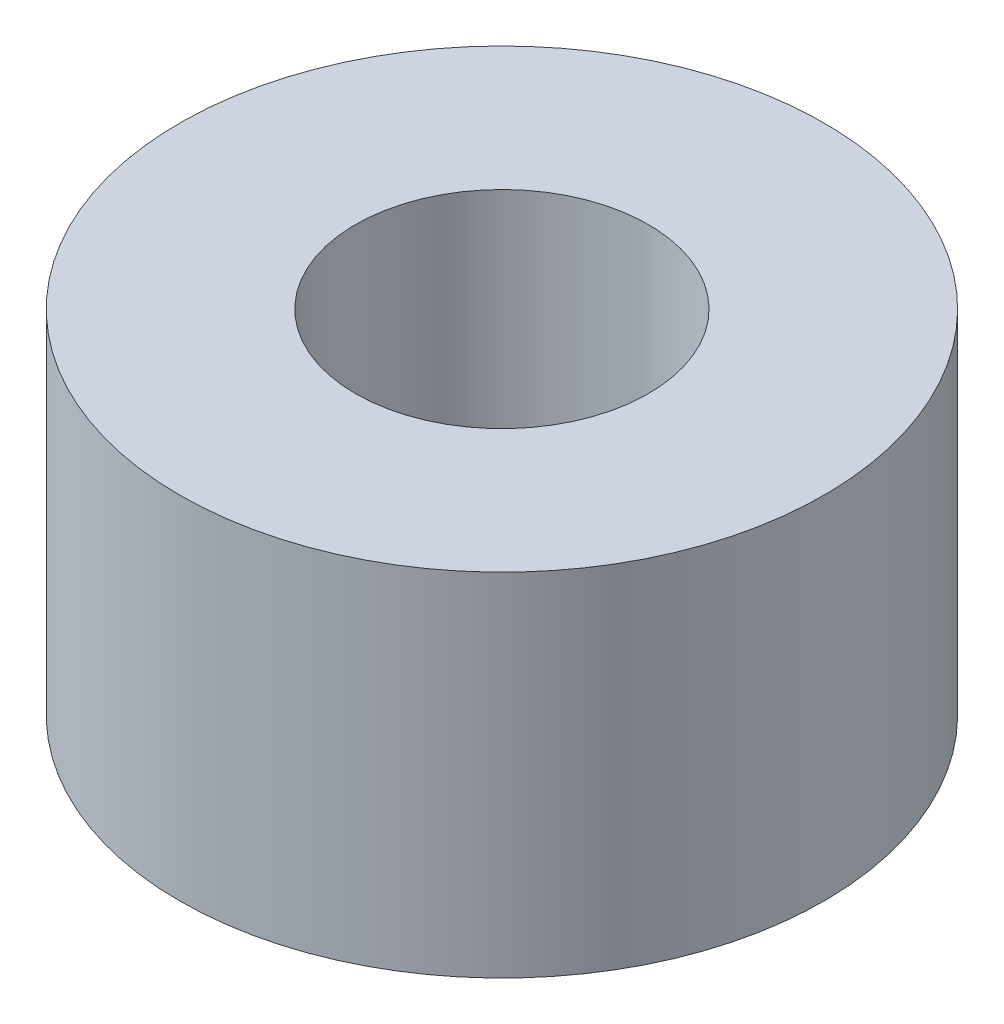
ISO-10303-21;
HEADER;
FILE_DESCRIPTION(('STEP AP214'),'2;1');
FILE_NAME('part.step','',(''),(''),'','','');
FILE_SCHEMA(('AUTOMOTIVE_DESIGN { 1 0 10303 214 1 1 1 1 }'));
ENDSEC;
DATA;
#1=APPLICATION_CONTEXT('core data for automotive mechanical design processes');
#2=APPLICATION_PROTOCOL_DEFINITION('international standard','automotive_design',2000,#1);
#3=PRODUCT_CONTEXT('',#1,'mechanical');
#4=PRODUCT('Part','Part','',(#3));
#5=PRODUCT_RELATED_PRODUCT_CATEGORY('part','',(#4));
#6=PRODUCT_DEFINITION_FORMATION('','',#4);
#7=PRODUCT_DEFINITION_CONTEXT('part definition',#1,'design');
#8=PRODUCT_DEFINITION('design','',#6,#7);
#9=PRODUCT_DEFINITION_SHAPE('','',#8);
#10=(LENGTH_UNIT() NAMED_UNIT(*) SI_UNIT(.MILLI.,.METRE.));
#11=(NAMED_UNIT(*) PLANE_ANGLE_UNIT() SI_UNIT($,.RADIAN.));
#12=(NAMED_UNIT(*) SI_UNIT($,.STERADIAN.) SOLID_ANGLE_UNIT());
#13=UNCERTAINTY_MEASURE_WITH_UNIT(LENGTH_MEASURE(1.E-05),#10,'distance_accuracy_value','');
#14=(GEOMETRIC_REPRESENTATION_CONTEXT(3) GLOBAL_UNCERTAINTY_ASSIGNED_CONTEXT((#13)) GLOBAL_UNIT_ASSIGNED_CONTEXT((#10,
#11,#12)) REPRESENTATION_CONTEXT('',''));
#15=CARTESIAN_POINT('',(0.,0.,0.));
#16=DIRECTION('',(0.,0.,1.));
#17=DIRECTION('',(1.,0.,0.));
#18=AXIS2_PLACEMENT_3D('',#15,#16,#17);
#19=CARTESIAN_POINT('',(0.,6.,0.));
#20=DIRECTION('',(0.,1.,0.));
#21=DIRECTION('',(0.,0.,1.));
#22=AXIS2_PLACEMENT_3D('',#19,#20,#21);
#23=PLANE('',#22);
#24=CARTESIAN_POINT('',(0.,6.,0.));
#25=DIRECTION('',(0.,1.,0.));
#26=DIRECTION('',(0.,0.,1.));
#27=AXIS2_PLACEMENT_3D('',#24,#25,#26);
#28=CIRCLE('',#27,5.5);
#29=CARTESIAN_POINT('',(0.,6.,5.5));
#30=VERTEX_POINT('',#29);
#31=EDGE_CURVE('E10',#30,#30,#28,.T.);
#32=ORIENTED_EDGE('',*,*,#31,.T.);
#33=EDGE_LOOP('',(#32));
#34=FACE_BOUND('',#33,.T.);
#35=CARTESIAN_POINT('',(0.,6.,0.));
#36=DIRECTION('',(0.,1.,0.));
#37=DIRECTION('',(0.,0.,1.));
#38=AXIS2_PLACEMENT_3D('',#35,#36,#37);
#39=CIRCLE('',#38,2.5);
#40=CARTESIAN_POINT('',(0.,6.,2.5));
#41=VERTEX_POINT('',#40);
#42=EDGE_CURVE('E42',#41,#41,#39,.T.);
#43=ORIENTED_EDGE('',*,*,#42,.F.);
#44=EDGE_LOOP('',(#43));
#45=FACE_BOUND('',#44,.T.);
#46=ADVANCED_FACE('F31',(#34,#45),#23,.T.);
#47=CARTESIAN_POINT('',(0.,0.,0.));
#48=DIRECTION('',(0.,1.,0.));
#49=DIRECTION('',(0.,0.,1.));
#50=AXIS2_PLACEMENT_3D('',#47,#48,#49);
#51=PLANE('',#50);
#52=CARTESIAN_POINT('',(0.,0.,0.));
#53=DIRECTION('',(0.,1.,0.));
#54=DIRECTION('',(0.,0.,1.));
#55=AXIS2_PLACEMENT_3D('',#52,#53,#54);
#56=CIRCLE('',#55,5.5);
#57=CARTESIAN_POINT('',(0.,0.,5.5));
#58=VERTEX_POINT('',#57);
#59=EDGE_CURVE('E35',#58,#58,#56,.T.);
#60=ORIENTED_EDGE('',*,*,#59,.F.);
#61=EDGE_LOOP('',(#60));
#62=FACE_BOUND('',#61,.T.);
#63=CARTESIAN_POINT('',(0.,0.,0.));
#64=DIRECTION('',(0.,1.,0.));
#65=DIRECTION('',(0.,0.,1.));
#66=AXIS2_PLACEMENT_3D('',#63,#64,#65);
#67=CIRCLE('',#66,2.5);
#68=CARTESIAN_POINT('',(0.,0.,2.5));
#69=VERTEX_POINT('',#68);
#70=EDGE_CURVE('E44',#69,#69,#67,.T.);
#71=ORIENTED_EDGE('',*,*,#70,.T.);
#72=EDGE_LOOP('',(#71));
#73=FACE_BOUND('',#72,.T.);
#74=ADVANCED_FACE('F54',(#62,#73),#51,.F.);
#75=CARTESIAN_POINT('',(0.,6.,0.));
#76=DIRECTION('',(0.,-1.,0.));
#77=DIRECTION('',(0.,0.,-1.));
#78=AXIS2_PLACEMENT_3D('',#75,#76,#77);
#79=CYLINDRICAL_SURFACE('',#78,5.5);
#80=ORIENTED_EDGE('',*,*,#31,.F.);
#81=EDGE_LOOP('',(#80));
#82=FACE_BOUND('',#81,.T.);
#83=ORIENTED_EDGE('',*,*,#59,.T.);
#84=EDGE_LOOP('',(#83));
#85=FACE_BOUND('',#84,.T.);
#86=ADVANCED_FACE('F33',(#82,#85),#79,.T.);
#87=CARTESIAN_POINT('',(0.,6.,0.));
#88=DIRECTION('',(0.,-1.,0.));
#89=DIRECTION('',(0.,0.,-1.));
#90=AXIS2_PLACEMENT_3D('',#87,#88,#89);
#91=CYLINDRICAL_SURFACE('',#90,2.5);
#92=ORIENTED_EDGE('',*,*,#42,.T.);
#93=EDGE_LOOP('',(#92));
#94=FACE_BOUND('',#93,.T.);
#95=ORIENTED_EDGE('',*,*,#70,.F.);
#96=EDGE_LOOP('',(#95));
#97=FACE_BOUND('',#96,.T.);
#98=ADVANCED_FACE('F50',(#94,#97),#91,.F.);
#99=CLOSED_SHELL('',(#46,#74,#86,#98));
#100=MANIFOLD_SOLID_BREP('B2',#99);
#101=ADVANCED_BREP_SHAPE_REPRESENTATION('',(#18,#100),#14);
#102=SHAPE_DEFINITION_REPRESENTATION(#9,#101);
ENDSEC;
END-ISO-10303-21;
